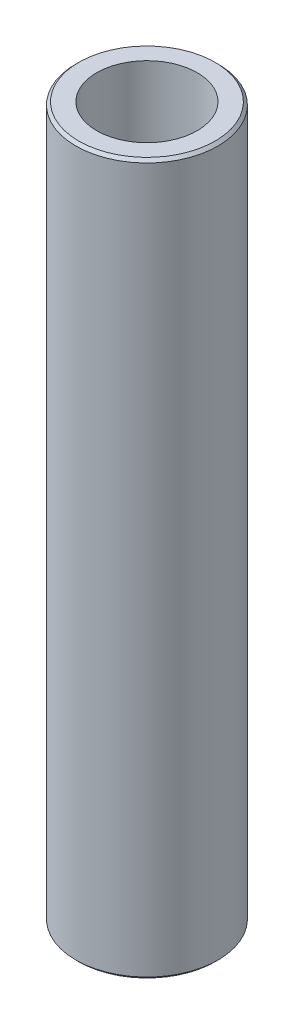
ISO-10303-21;
HEADER;
FILE_DESCRIPTION(('STEP AP214'),'2;1');
FILE_NAME('part.step','',(''),(''),'','','');
FILE_SCHEMA(('AUTOMOTIVE_DESIGN { 1 0 10303 214 1 1 1 1 }'));
ENDSEC;
DATA;
#1=APPLICATION_CONTEXT('core data for automotive mechanical design processes');
#2=APPLICATION_PROTOCOL_DEFINITION('international standard','automotive_design',2000,#1);
#3=PRODUCT_CONTEXT('',#1,'mechanical');
#4=PRODUCT('Part','Part','',(#3));
#5=PRODUCT_RELATED_PRODUCT_CATEGORY('part','',(#4));
#6=PRODUCT_DEFINITION_FORMATION('','',#4);
#7=PRODUCT_DEFINITION_CONTEXT('part definition',#1,'design');
#8=PRODUCT_DEFINITION('design','',#6,#7);
#9=PRODUCT_DEFINITION_SHAPE('','',#8);
#10=(LENGTH_UNIT() NAMED_UNIT(*) SI_UNIT(.MILLI.,.METRE.));
#11=(NAMED_UNIT(*) PLANE_ANGLE_UNIT() SI_UNIT($,.RADIAN.));
#12=(NAMED_UNIT(*) SI_UNIT($,.STERADIAN.) SOLID_ANGLE_UNIT());
#13=UNCERTAINTY_MEASURE_WITH_UNIT(LENGTH_MEASURE(1.E-05),#10,'distance_accuracy_value','');
#14=(GEOMETRIC_REPRESENTATION_CONTEXT(3) GLOBAL_UNCERTAINTY_ASSIGNED_CONTEXT((#13)) GLOBAL_UNIT_ASSIGNED_CONTEXT((#10,
#11,#12)) REPRESENTATION_CONTEXT('',''));
#15=CARTESIAN_POINT('',(0.,0.,0.));
#16=DIRECTION('',(0.,0.,1.));
#17=DIRECTION('',(1.,0.,0.));
#18=AXIS2_PLACEMENT_3D('',#15,#16,#17);
#19=CARTESIAN_POINT('',(0.,600.,0.));
#20=DIRECTION('',(0.,-1.,0.));
#21=DIRECTION('',(0.,0.,-1.));
#22=AXIS2_PLACEMENT_3D('',#19,#20,#21);
#23=CYLINDRICAL_SURFACE('',#22,60.);
#24=CARTESIAN_POINT('',(0.,597.587381660756,0.));
#25=DIRECTION('',(0.,1.,0.));
#26=DIRECTION('',(0.,0.,1.));
#27=AXIS2_PLACEMENT_3D('',#24,#25,#26);
#28=CIRCLE('',#27,60.);
#29=CARTESIAN_POINT('',(0.,597.587381660756,60.));
#30=VERTEX_POINT('',#29);
#31=EDGE_CURVE('E50',#30,#30,#28,.F.);
#32=ORIENTED_EDGE('',*,*,#31,.T.);
#33=EDGE_LOOP('',(#32));
#34=FACE_BOUND('',#33,.T.);
#35=CARTESIAN_POINT('',(0.,2.41261833924444,0.));
#36=DIRECTION('',(0.,1.,0.));
#37=DIRECTION('',(0.,0.,1.));
#38=AXIS2_PLACEMENT_3D('',#35,#36,#37);
#39=CIRCLE('',#38,60.);
#40=CARTESIAN_POINT('',(0.,2.41261833924444,60.));
#41=VERTEX_POINT('',#40);
#42=EDGE_CURVE('E51',#41,#41,#39,.T.);
#43=ORIENTED_EDGE('',*,*,#42,.T.);
#44=EDGE_LOOP('',(#43));
#45=FACE_BOUND('',#44,.T.);
#46=ADVANCED_FACE('F39',(#34,#45),#23,.T.);
#47=CARTESIAN_POINT('',(0.,600.,0.));
#48=DIRECTION('',(0.,1.,0.));
#49=DIRECTION('',(0.,0.,1.));
#50=AXIS2_PLACEMENT_3D('',#47,#48,#49);
#51=PLANE('',#50);
#52=CARTESIAN_POINT('',(0.,600.,0.));
#53=DIRECTION('',(0.,1.,0.));
#54=DIRECTION('',(0.,0.,1.));
#55=AXIS2_PLACEMENT_3D('',#52,#53,#54);
#56=CIRCLE('',#55,57.5873816607556);
#57=CARTESIAN_POINT('',(0.,600.,57.5873816607556));
#58=VERTEX_POINT('',#57);
#59=EDGE_CURVE('E54',#58,#58,#56,.T.);
#60=ORIENTED_EDGE('',*,*,#59,.T.);
#61=EDGE_LOOP('',(#60));
#62=FACE_BOUND('',#61,.T.);
#63=CARTESIAN_POINT('',(0.,600.,0.));
#64=DIRECTION('',(0.,1.,0.));
#65=DIRECTION('',(0.,0.,1.));
#66=AXIS2_PLACEMENT_3D('',#63,#64,#65);
#67=CIRCLE('',#66,42.4386772464294);
#68=CARTESIAN_POINT('',(0.,600.,42.4386772464294));
#69=VERTEX_POINT('',#68);
#70=EDGE_CURVE('E58',#69,#69,#67,.T.);
#71=ORIENTED_EDGE('',*,*,#70,.F.);
#72=EDGE_LOOP('',(#71));
#73=FACE_BOUND('',#72,.T.);
#74=ADVANCED_FACE('F69',(#62,#73),#51,.T.);
#75=CARTESIAN_POINT('',(0.,0.,0.));
#76=DIRECTION('',(0.,1.,0.));
#77=DIRECTION('',(0.,0.,1.));
#78=AXIS2_PLACEMENT_3D('',#75,#76,#77);
#79=PLANE('',#78);
#80=CARTESIAN_POINT('',(0.,0.,0.));
#81=DIRECTION('',(0.,1.,0.));
#82=DIRECTION('',(0.,0.,1.));
#83=AXIS2_PLACEMENT_3D('',#80,#81,#82);
#84=CIRCLE('',#83,57.5873816607556);
#85=CARTESIAN_POINT('',(0.,0.,57.5873816607556));
#86=VERTEX_POINT('',#85);
#87=EDGE_CURVE('E10',#86,#86,#84,.F.);
#88=ORIENTED_EDGE('',*,*,#87,.T.);
#89=EDGE_LOOP('',(#88));
#90=FACE_BOUND('',#89,.T.);
#91=CARTESIAN_POINT('',(0.,0.,0.));
#92=DIRECTION('',(0.,1.,0.));
#93=DIRECTION('',(0.,0.,1.));
#94=AXIS2_PLACEMENT_3D('',#91,#92,#93);
#95=CIRCLE('',#94,42.4386772464294);
#96=CARTESIAN_POINT('',(0.,0.,42.4386772464294));
#97=VERTEX_POINT('',#96);
#98=EDGE_CURVE('E63',#97,#97,#95,.T.);
#99=ORIENTED_EDGE('',*,*,#98,.T.);
#100=EDGE_LOOP('',(#99));
#101=FACE_BOUND('',#100,.T.);
#102=ADVANCED_FACE('F75',(#90,#101),#79,.F.);
#103=CARTESIAN_POINT('',(0.,600.,0.));
#104=DIRECTION('',(0.,-1.,0.));
#105=DIRECTION('',(0.,0.,-1.));
#106=AXIS2_PLACEMENT_3D('',#103,#104,#105);
#107=CYLINDRICAL_SURFACE('',#106,42.4386772464294);
#108=ORIENTED_EDGE('',*,*,#70,.T.);
#109=EDGE_LOOP('',(#108));
#110=FACE_BOUND('',#109,.T.);
#111=ORIENTED_EDGE('',*,*,#98,.F.);
#112=EDGE_LOOP('',(#111));
#113=FACE_BOUND('',#112,.T.);
#114=ADVANCED_FACE('F70',(#110,#113),#107,.F.);
#115=CARTESIAN_POINT('',(0.,600.,0.));
#116=DIRECTION('',(0.,-1.,0.));
#117=DIRECTION('',(0.,0.,-1.));
#118=AXIS2_PLACEMENT_3D('',#115,#116,#117);
#119=CONICAL_SURFACE('',#118,57.5873816607556,0.785398163397448);
#120=ORIENTED_EDGE('',*,*,#31,.F.);
#121=EDGE_LOOP('',(#120));
#122=FACE_BOUND('',#121,.T.);
#123=ORIENTED_EDGE('',*,*,#59,.F.);
#124=EDGE_LOOP('',(#123));
#125=FACE_BOUND('',#124,.T.);
#126=ADVANCED_FACE('F81',(#122,#125),#119,.T.);
#127=CARTESIAN_POINT('',(0.,2.41261833924444,0.));
#128=DIRECTION('',(0.,1.,0.));
#129=DIRECTION('',(0.,0.,1.));
#130=AXIS2_PLACEMENT_3D('',#127,#128,#129);
#131=CONICAL_SURFACE('',#130,60.,0.785398163397437);
#132=ORIENTED_EDGE('',*,*,#87,.F.);
#133=EDGE_LOOP('',(#132));
#134=FACE_BOUND('',#133,.T.);
#135=ORIENTED_EDGE('',*,*,#42,.F.);
#136=EDGE_LOOP('',(#135));
#137=FACE_BOUND('',#136,.T.);
#138=ADVANCED_FACE('F45',(#134,#137),#131,.T.);
#139=CLOSED_SHELL('',(#46,#74,#102,#114,#126,#138));
#140=MANIFOLD_SOLID_BREP('B2',#139);
#141=ADVANCED_BREP_SHAPE_REPRESENTATION('',(#18,#140),#14);
#142=SHAPE_DEFINITION_REPRESENTATION(#9,#141);
ENDSEC;
END-ISO-10303-21;
